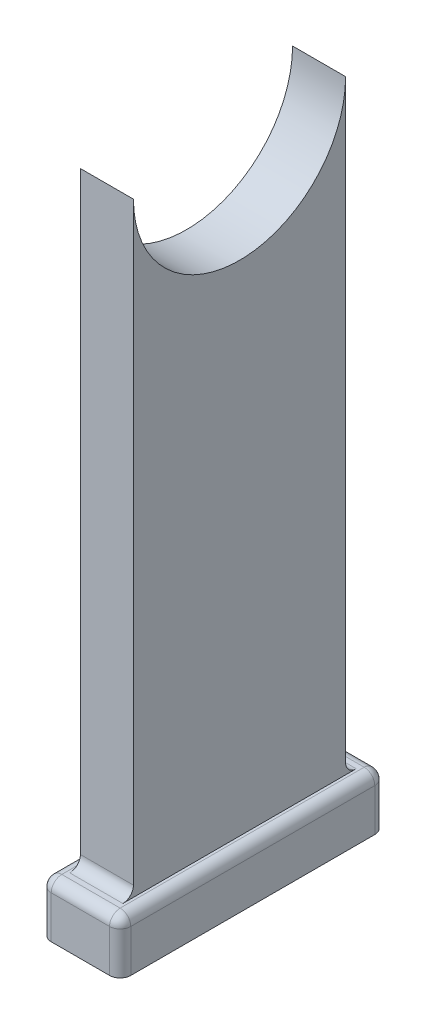
ISO-10303-21;
HEADER;
FILE_DESCRIPTION(('STEP AP214'),'2;1');
FILE_NAME('part.step','',(''),(''),'','','');
FILE_SCHEMA(('AUTOMOTIVE_DESIGN { 1 0 10303 214 1 1 1 1 }'));
ENDSEC;
DATA;
#1=APPLICATION_CONTEXT('core data for automotive mechanical design processes');
#2=APPLICATION_PROTOCOL_DEFINITION('international standard','automotive_design',2000,#1);
#3=PRODUCT_CONTEXT('',#1,'mechanical');
#4=PRODUCT('Part','Part','',(#3));
#5=PRODUCT_RELATED_PRODUCT_CATEGORY('part','',(#4));
#6=PRODUCT_DEFINITION_FORMATION('','',#4);
#7=PRODUCT_DEFINITION_CONTEXT('part definition',#1,'design');
#8=PRODUCT_DEFINITION('design','',#6,#7);
#9=PRODUCT_DEFINITION_SHAPE('','',#8);
#10=(LENGTH_UNIT() NAMED_UNIT(*) SI_UNIT(.MILLI.,.METRE.));
#11=(NAMED_UNIT(*) PLANE_ANGLE_UNIT() SI_UNIT($,.RADIAN.));
#12=(NAMED_UNIT(*) SI_UNIT($,.STERADIAN.) SOLID_ANGLE_UNIT());
#13=UNCERTAINTY_MEASURE_WITH_UNIT(LENGTH_MEASURE(1.E-05),#10,'distance_accuracy_value','');
#14=(GEOMETRIC_REPRESENTATION_CONTEXT(3) GLOBAL_UNCERTAINTY_ASSIGNED_CONTEXT((#13)) GLOBAL_UNIT_ASSIGNED_CONTEXT((#10,
#11,#12)) REPRESENTATION_CONTEXT('',''));
#15=CARTESIAN_POINT('',(0.,0.,0.));
#16=DIRECTION('',(0.,0.,1.));
#17=DIRECTION('',(1.,0.,0.));
#18=AXIS2_PLACEMENT_3D('',#15,#16,#17);
#19=CARTESIAN_POINT('',(-7.5,10.,25.));
#20=DIRECTION('',(1.,0.,0.));
#21=DIRECTION('',(0.,0.,-1.));
#22=AXIS2_PLACEMENT_3D('',#19,#20,#21);
#23=PLANE('',#22);
#24=DIRECTION('',(0.,0.,1.));
#25=VECTOR('',#24,1.);
#26=CARTESIAN_POINT('',(-7.5,8.,-25.));
#27=LINE('',#26,#25);
#28=CARTESIAN_POINT('',(-7.5,8.,23.));
#29=VERTEX_POINT('',#28);
#30=CARTESIAN_POINT('',(-7.5,8.,-23.));
#31=VERTEX_POINT('',#30);
#32=EDGE_CURVE('E226',#29,#31,#27,.F.);
#33=ORIENTED_EDGE('',*,*,#32,.T.);
#34=DIRECTION('',(0.,-1.,0.));
#35=VECTOR('',#34,1.);
#36=CARTESIAN_POINT('',(-7.5,10.,-23.));
#37=LINE('',#36,#35);
#38=CARTESIAN_POINT('',(-7.5,0.,-23.));
#39=VERTEX_POINT('',#38);
#40=EDGE_CURVE('E254',#31,#39,#37,.T.);
#41=ORIENTED_EDGE('',*,*,#40,.T.);
#42=DIRECTION('',(0.,0.,1.));
#43=VECTOR('',#42,1.);
#44=CARTESIAN_POINT('',(-7.5,0.,25.));
#45=LINE('',#44,#43);
#46=CARTESIAN_POINT('',(-7.5,0.,23.));
#47=VERTEX_POINT('',#46);
#48=EDGE_CURVE('E195',#39,#47,#45,.T.);
#49=ORIENTED_EDGE('',*,*,#48,.T.);
#50=DIRECTION('',(0.,-1.,0.));
#51=VECTOR('',#50,1.);
#52=CARTESIAN_POINT('',(-7.5,10.,23.));
#53=LINE('',#52,#51);
#54=EDGE_CURVE('E252',#47,#29,#53,.F.);
#55=ORIENTED_EDGE('',*,*,#54,.T.);
#56=EDGE_LOOP('',(#33,#41,#49,#55));
#57=FACE_BOUND('',#56,.T.);
#58=ADVANCED_FACE('F45',(#57),#23,.F.);
#59=CARTESIAN_POINT('',(7.5,10.,25.));
#60=DIRECTION('',(0.,0.,-1.));
#61=DIRECTION('',(-1.,0.,0.));
#62=AXIS2_PLACEMENT_3D('',#59,#60,#61);
#63=PLANE('',#62);
#64=DIRECTION('',(1.,0.,0.));
#65=VECTOR('',#64,1.);
#66=CARTESIAN_POINT('',(7.5,0.,25.));
#67=LINE('',#66,#65);
#68=CARTESIAN_POINT('',(-5.5,0.,25.));
#69=VERTEX_POINT('',#68);
#70=CARTESIAN_POINT('',(5.5,0.,25.));
#71=VERTEX_POINT('',#70);
#72=EDGE_CURVE('E198',#69,#71,#67,.T.);
#73=ORIENTED_EDGE('',*,*,#72,.T.);
#74=DIRECTION('',(0.,-1.,0.));
#75=VECTOR('',#74,1.);
#76=CARTESIAN_POINT('',(5.5,10.,25.));
#77=LINE('',#76,#75);
#78=CARTESIAN_POINT('',(5.5,8.,25.));
#79=VERTEX_POINT('',#78);
#80=EDGE_CURVE('E274',#71,#79,#77,.F.);
#81=ORIENTED_EDGE('',*,*,#80,.T.);
#82=DIRECTION('',(1.,0.,0.));
#83=VECTOR('',#82,1.);
#84=CARTESIAN_POINT('',(-7.5,8.,25.));
#85=LINE('',#84,#83);
#86=CARTESIAN_POINT('',(-5.5,8.,25.));
#87=VERTEX_POINT('',#86);
#88=EDGE_CURVE('E223',#79,#87,#85,.F.);
#89=ORIENTED_EDGE('',*,*,#88,.T.);
#90=DIRECTION('',(0.,-1.,0.));
#91=VECTOR('',#90,1.);
#92=CARTESIAN_POINT('',(-5.5,10.,25.));
#93=LINE('',#92,#91);
#94=EDGE_CURVE('E272',#87,#69,#93,.T.);
#95=ORIENTED_EDGE('',*,*,#94,.T.);
#96=EDGE_LOOP('',(#73,#81,#89,#95));
#97=FACE_BOUND('',#96,.T.);
#98=ADVANCED_FACE('F319',(#97),#63,.F.);
#99=CARTESIAN_POINT('',(7.5,10.,25.));
#100=DIRECTION('',(-1.,0.,0.));
#101=DIRECTION('',(0.,0.,1.));
#102=AXIS2_PLACEMENT_3D('',#99,#100,#101);
#103=PLANE('',#102);
#104=DIRECTION('',(0.,0.,-1.));
#105=VECTOR('',#104,1.);
#106=CARTESIAN_POINT('',(7.5,0.,25.));
#107=LINE('',#106,#105);
#108=CARTESIAN_POINT('',(7.5,0.,23.));
#109=VERTEX_POINT('',#108);
#110=CARTESIAN_POINT('',(7.5,0.,-23.));
#111=VERTEX_POINT('',#110);
#112=EDGE_CURVE('E202',#109,#111,#107,.T.);
#113=ORIENTED_EDGE('',*,*,#112,.T.);
#114=DIRECTION('',(0.,-1.,0.));
#115=VECTOR('',#114,1.);
#116=CARTESIAN_POINT('',(7.5,10.,-23.));
#117=LINE('',#116,#115);
#118=CARTESIAN_POINT('',(7.5,8.,-23.));
#119=VERTEX_POINT('',#118);
#120=EDGE_CURVE('E270',#111,#119,#117,.F.);
#121=ORIENTED_EDGE('',*,*,#120,.T.);
#122=DIRECTION('',(0.,0.,-1.));
#123=VECTOR('',#122,1.);
#124=CARTESIAN_POINT('',(7.5,8.,25.));
#125=LINE('',#124,#123);
#126=CARTESIAN_POINT('',(7.5,8.,23.));
#127=VERTEX_POINT('',#126);
#128=EDGE_CURVE('E220',#119,#127,#125,.F.);
#129=ORIENTED_EDGE('',*,*,#128,.T.);
#130=DIRECTION('',(0.,-1.,0.));
#131=VECTOR('',#130,1.);
#132=CARTESIAN_POINT('',(7.5,10.,23.));
#133=LINE('',#132,#131);
#134=EDGE_CURVE('E268',#127,#109,#133,.T.);
#135=ORIENTED_EDGE('',*,*,#134,.T.);
#136=EDGE_LOOP('',(#113,#121,#129,#135));
#137=FACE_BOUND('',#136,.T.);
#138=ADVANCED_FACE('F325',(#137),#103,.F.);
#139=CARTESIAN_POINT('',(7.5,10.,-25.));
#140=DIRECTION('',(0.,0.,1.));
#141=DIRECTION('',(1.,0.,0.));
#142=AXIS2_PLACEMENT_3D('',#139,#140,#141);
#143=PLANE('',#142);
#144=DIRECTION('',(-1.,0.,0.));
#145=VECTOR('',#144,1.);
#146=CARTESIAN_POINT('',(7.5,0.,-25.));
#147=LINE('',#146,#145);
#148=CARTESIAN_POINT('',(5.5,0.,-25.));
#149=VERTEX_POINT('',#148);
#150=CARTESIAN_POINT('',(-5.5,0.,-25.));
#151=VERTEX_POINT('',#150);
#152=EDGE_CURVE('E205',#149,#151,#147,.T.);
#153=ORIENTED_EDGE('',*,*,#152,.T.);
#154=DIRECTION('',(0.,-1.,0.));
#155=VECTOR('',#154,1.);
#156=CARTESIAN_POINT('',(-5.5,10.,-25.));
#157=LINE('',#156,#155);
#158=CARTESIAN_POINT('',(-5.5,8.,-25.));
#159=VERTEX_POINT('',#158);
#160=EDGE_CURVE('E266',#151,#159,#157,.F.);
#161=ORIENTED_EDGE('',*,*,#160,.T.);
#162=DIRECTION('',(-1.,0.,0.));
#163=VECTOR('',#162,1.);
#164=CARTESIAN_POINT('',(7.5,8.,-25.));
#165=LINE('',#164,#163);
#166=CARTESIAN_POINT('',(5.5,8.,-25.));
#167=VERTEX_POINT('',#166);
#168=EDGE_CURVE('E229',#159,#167,#165,.F.);
#169=ORIENTED_EDGE('',*,*,#168,.T.);
#170=DIRECTION('',(0.,-1.,0.));
#171=VECTOR('',#170,1.);
#172=CARTESIAN_POINT('',(5.5,10.,-25.));
#173=LINE('',#172,#171);
#174=EDGE_CURVE('E264',#167,#149,#173,.T.);
#175=ORIENTED_EDGE('',*,*,#174,.T.);
#176=EDGE_LOOP('',(#153,#161,#169,#175));
#177=FACE_BOUND('',#176,.T.);
#178=ADVANCED_FACE('F421',(#177),#143,.F.);
#179=CARTESIAN_POINT('',(0.,10.,0.));
#180=DIRECTION('',(0.,1.,0.));
#181=DIRECTION('',(0.,0.,1.));
#182=AXIS2_PLACEMENT_3D('',#179,#180,#181);
#183=PLANE('',#182);
#184=DIRECTION('',(1.,0.,0.));
#185=VECTOR('',#184,1.);
#186=CARTESIAN_POINT('',(0.,10.,-21.9999999999999));
#187=LINE('',#186,#185);
#188=CARTESIAN_POINT('',(-5.,10.,-21.9999999999999));
#189=VERTEX_POINT('',#188);
#190=CARTESIAN_POINT('',(5.,10.,-21.9999999999999));
#191=VERTEX_POINT('',#190);
#192=EDGE_CURVE('E287',#189,#191,#187,.T.);
#193=ORIENTED_EDGE('',*,*,#192,.T.);
#194=DIRECTION('',(0.,0.,-1.));
#195=VECTOR('',#194,1.);
#196=CARTESIAN_POINT('',(5.,10.,0.));
#197=LINE('',#196,#195);
#198=CARTESIAN_POINT('',(5.,10.,22.));
#199=VERTEX_POINT('',#198);
#200=EDGE_CURVE('E192',#199,#191,#197,.T.);
#201=ORIENTED_EDGE('',*,*,#200,.F.);
#202=DIRECTION('',(-1.,0.,0.));
#203=VECTOR('',#202,1.);
#204=CARTESIAN_POINT('',(0.,10.,22.));
#205=LINE('',#204,#203);
#206=CARTESIAN_POINT('',(-5.,10.,22.));
#207=VERTEX_POINT('',#206);
#208=EDGE_CURVE('E276',#199,#207,#205,.T.);
#209=ORIENTED_EDGE('',*,*,#208,.T.);
#210=DIRECTION('',(0.,0.,-1.));
#211=VECTOR('',#210,1.);
#212=CARTESIAN_POINT('',(-5.,10.,0.));
#213=LINE('',#212,#211);
#214=EDGE_CURVE('E177',#207,#189,#213,.T.);
#215=ORIENTED_EDGE('',*,*,#214,.T.);
#216=EDGE_LOOP('',(#193,#201,#209,#215));
#217=FACE_BOUND('',#216,.T.);
#218=DIRECTION('',(1.,0.,0.));
#219=VECTOR('',#218,1.);
#220=CARTESIAN_POINT('',(7.5,10.,23.));
#221=LINE('',#220,#219);
#222=CARTESIAN_POINT('',(-5.5,10.,23.));
#223=VERTEX_POINT('',#222);
#224=CARTESIAN_POINT('',(5.5,10.,23.));
#225=VERTEX_POINT('',#224);
#226=EDGE_CURVE('E214',#223,#225,#221,.T.);
#227=ORIENTED_EDGE('',*,*,#226,.T.);
#228=DIRECTION('',(0.,0.,-1.));
#229=VECTOR('',#228,1.);
#230=CARTESIAN_POINT('',(5.5,10.,-25.));
#231=LINE('',#230,#229);
#232=CARTESIAN_POINT('',(5.5,10.,-23.));
#233=VERTEX_POINT('',#232);
#234=EDGE_CURVE('E217',#225,#233,#231,.T.);
#235=ORIENTED_EDGE('',*,*,#234,.T.);
#236=DIRECTION('',(-1.,0.,0.));
#237=VECTOR('',#236,1.);
#238=CARTESIAN_POINT('',(-7.5,10.,-23.));
#239=LINE('',#238,#237);
#240=CARTESIAN_POINT('',(-5.5,10.,-23.));
#241=VERTEX_POINT('',#240);
#242=EDGE_CURVE('E208',#233,#241,#239,.T.);
#243=ORIENTED_EDGE('',*,*,#242,.T.);
#244=DIRECTION('',(0.,0.,1.));
#245=VECTOR('',#244,1.);
#246=CARTESIAN_POINT('',(-5.5,10.,25.));
#247=LINE('',#246,#245);
#248=EDGE_CURVE('E211',#241,#223,#247,.T.);
#249=ORIENTED_EDGE('',*,*,#248,.T.);
#250=EDGE_LOOP('',(#227,#235,#243,#249));
#251=FACE_BOUND('',#250,.T.);
#252=ADVANCED_FACE('F302',(#217,#251),#183,.T.);
#253=CARTESIAN_POINT('',(0.,0.,0.));
#254=DIRECTION('',(0.,1.,0.));
#255=DIRECTION('',(0.,0.,1.));
#256=AXIS2_PLACEMENT_3D('',#253,#254,#255);
#257=PLANE('',#256);
#258=ORIENTED_EDGE('',*,*,#48,.F.);
#259=CARTESIAN_POINT('',(-5.5,0.,-23.));
#260=DIRECTION('',(0.,1.,0.));
#261=DIRECTION('',(0.,0.,1.));
#262=AXIS2_PLACEMENT_3D('',#259,#260,#261);
#263=CIRCLE('',#262,2.);
#264=EDGE_CURVE('E262',#39,#151,#263,.F.);
#265=ORIENTED_EDGE('',*,*,#264,.T.);
#266=ORIENTED_EDGE('',*,*,#152,.F.);
#267=CARTESIAN_POINT('',(5.5,0.,-23.));
#268=DIRECTION('',(0.,1.,0.));
#269=DIRECTION('',(0.,0.,1.));
#270=AXIS2_PLACEMENT_3D('',#267,#268,#269);
#271=CIRCLE('',#270,2.);
#272=EDGE_CURVE('E260',#149,#111,#271,.F.);
#273=ORIENTED_EDGE('',*,*,#272,.T.);
#274=ORIENTED_EDGE('',*,*,#112,.F.);
#275=CARTESIAN_POINT('',(5.5,0.,23.));
#276=DIRECTION('',(0.,1.,0.));
#277=DIRECTION('',(0.,0.,1.));
#278=AXIS2_PLACEMENT_3D('',#275,#276,#277);
#279=CIRCLE('',#278,2.);
#280=EDGE_CURVE('E258',#109,#71,#279,.F.);
#281=ORIENTED_EDGE('',*,*,#280,.T.);
#282=ORIENTED_EDGE('',*,*,#72,.F.);
#283=CARTESIAN_POINT('',(-5.5,0.,23.));
#284=DIRECTION('',(0.,1.,0.));
#285=DIRECTION('',(0.,0.,1.));
#286=AXIS2_PLACEMENT_3D('',#283,#284,#285);
#287=CIRCLE('',#286,2.);
#288=EDGE_CURVE('E256',#69,#47,#287,.F.);
#289=ORIENTED_EDGE('',*,*,#288,.T.);
#290=EDGE_LOOP('',(#258,#265,#266,#273,#274,#281,#282,#289));
#291=FACE_BOUND('',#290,.T.);
#292=ADVANCED_FACE('F346',(#291),#257,.F.);
#293=CARTESIAN_POINT('',(-5.5,8.,0.));
#294=DIRECTION('',(0.,0.,-1.));
#295=DIRECTION('',(-1.,0.,0.));
#296=AXIS2_PLACEMENT_3D('',#293,#294,#295);
#297=CYLINDRICAL_SURFACE('',#296,2.);
#298=ORIENTED_EDGE('',*,*,#248,.F.);
#299=CARTESIAN_POINT('',(-5.5,8.,-23.));
#300=DIRECTION('',(0.,0.,-1.));
#301=DIRECTION('',(-1.,0.,0.));
#302=AXIS2_PLACEMENT_3D('',#299,#300,#301);
#303=CIRCLE('',#302,2.);
#304=EDGE_CURVE('E239',#241,#31,#303,.F.);
#305=ORIENTED_EDGE('',*,*,#304,.T.);
#306=ORIENTED_EDGE('',*,*,#32,.F.);
#307=CARTESIAN_POINT('',(-5.5,8.,23.));
#308=DIRECTION('',(0.,0.,-1.));
#309=DIRECTION('',(-1.,0.,0.));
#310=AXIS2_PLACEMENT_3D('',#307,#308,#309);
#311=CIRCLE('',#310,2.);
#312=EDGE_CURVE('E237',#29,#223,#311,.T.);
#313=ORIENTED_EDGE('',*,*,#312,.T.);
#314=EDGE_LOOP('',(#298,#305,#306,#313));
#315=FACE_BOUND('',#314,.T.);
#316=ADVANCED_FACE('F342',(#315),#297,.T.);
#317=CARTESIAN_POINT('',(0.,8.,23.));
#318=DIRECTION('',(-1.,0.,0.));
#319=DIRECTION('',(0.,0.,1.));
#320=AXIS2_PLACEMENT_3D('',#317,#318,#319);
#321=CYLINDRICAL_SURFACE('',#320,2.);
#322=ORIENTED_EDGE('',*,*,#88,.F.);
#323=CARTESIAN_POINT('',(5.5,8.,23.));
#324=DIRECTION('',(-1.,0.,0.));
#325=DIRECTION('',(0.,0.,1.));
#326=AXIS2_PLACEMENT_3D('',#323,#324,#325);
#327=CIRCLE('',#326,2.);
#328=EDGE_CURVE('E250',#79,#225,#327,.T.);
#329=ORIENTED_EDGE('',*,*,#328,.T.);
#330=ORIENTED_EDGE('',*,*,#226,.F.);
#331=CARTESIAN_POINT('',(-5.5,8.,23.));
#332=DIRECTION('',(-1.,0.,0.));
#333=DIRECTION('',(0.,0.,1.));
#334=AXIS2_PLACEMENT_3D('',#331,#332,#333);
#335=CIRCLE('',#334,2.);
#336=EDGE_CURVE('E247',#223,#87,#335,.F.);
#337=ORIENTED_EDGE('',*,*,#336,.T.);
#338=EDGE_LOOP('',(#322,#329,#330,#337));
#339=FACE_BOUND('',#338,.T.);
#340=ADVANCED_FACE('F338',(#339),#321,.T.);
#341=CARTESIAN_POINT('',(0.,8.,-23.));
#342=DIRECTION('',(1.,0.,0.));
#343=DIRECTION('',(0.,0.,-1.));
#344=AXIS2_PLACEMENT_3D('',#341,#342,#343);
#345=CYLINDRICAL_SURFACE('',#344,2.);
#346=ORIENTED_EDGE('',*,*,#168,.F.);
#347=CARTESIAN_POINT('',(-5.5,8.,-23.));
#348=DIRECTION('',(1.,0.,0.));
#349=DIRECTION('',(0.,0.,-1.));
#350=AXIS2_PLACEMENT_3D('',#347,#348,#349);
#351=CIRCLE('',#350,2.);
#352=EDGE_CURVE('E234',#159,#241,#351,.T.);
#353=ORIENTED_EDGE('',*,*,#352,.T.);
#354=ORIENTED_EDGE('',*,*,#242,.F.);
#355=CARTESIAN_POINT('',(5.5,8.,-23.));
#356=DIRECTION('',(1.,0.,0.));
#357=DIRECTION('',(0.,0.,-1.));
#358=AXIS2_PLACEMENT_3D('',#355,#356,#357);
#359=CIRCLE('',#358,2.);
#360=EDGE_CURVE('E232',#233,#167,#359,.F.);
#361=ORIENTED_EDGE('',*,*,#360,.T.);
#362=EDGE_LOOP('',(#346,#353,#354,#361));
#363=FACE_BOUND('',#362,.T.);
#364=ADVANCED_FACE('F334',(#363),#345,.T.);
#365=CARTESIAN_POINT('',(5.5,8.,0.));
#366=DIRECTION('',(0.,0.,1.));
#367=DIRECTION('',(1.,0.,0.));
#368=AXIS2_PLACEMENT_3D('',#365,#366,#367);
#369=CYLINDRICAL_SURFACE('',#368,2.);
#370=ORIENTED_EDGE('',*,*,#128,.F.);
#371=CARTESIAN_POINT('',(5.5,8.,-23.));
#372=DIRECTION('',(0.,0.,1.));
#373=DIRECTION('',(1.,0.,0.));
#374=AXIS2_PLACEMENT_3D('',#371,#372,#373);
#375=CIRCLE('',#374,2.);
#376=EDGE_CURVE('E244',#119,#233,#375,.T.);
#377=ORIENTED_EDGE('',*,*,#376,.T.);
#378=ORIENTED_EDGE('',*,*,#234,.F.);
#379=CARTESIAN_POINT('',(5.5,8.,23.));
#380=DIRECTION('',(0.,0.,1.));
#381=DIRECTION('',(1.,0.,0.));
#382=AXIS2_PLACEMENT_3D('',#379,#380,#381);
#383=CIRCLE('',#382,2.);
#384=EDGE_CURVE('E241',#225,#127,#383,.F.);
#385=ORIENTED_EDGE('',*,*,#384,.T.);
#386=EDGE_LOOP('',(#370,#377,#378,#385));
#387=FACE_BOUND('',#386,.T.);
#388=ADVANCED_FACE('F330',(#387),#369,.T.);
#389=CARTESIAN_POINT('',(-5.5,10.,-23.));
#390=DIRECTION('',(0.,-1.,0.));
#391=DIRECTION('',(0.,0.,-1.));
#392=AXIS2_PLACEMENT_3D('',#389,#390,#391);
#393=CYLINDRICAL_SURFACE('',#392,2.);
#394=ORIENTED_EDGE('',*,*,#264,.F.);
#395=ORIENTED_EDGE('',*,*,#40,.F.);
#396=CARTESIAN_POINT('',(-5.5,8.,-23.));
#397=DIRECTION('',(0.,1.,0.));
#398=DIRECTION('',(0.,0.,1.));
#399=AXIS2_PLACEMENT_3D('',#396,#397,#398);
#400=CIRCLE('',#399,2.);
#401=EDGE_CURVE('E199',#159,#31,#400,.T.);
#402=ORIENTED_EDGE('',*,*,#401,.F.);
#403=ORIENTED_EDGE('',*,*,#160,.F.);
#404=EDGE_LOOP('',(#394,#395,#402,#403));
#405=FACE_BOUND('',#404,.T.);
#406=ADVANCED_FACE('F333',(#405),#393,.T.);
#407=CARTESIAN_POINT('',(-5.5,8.,-23.));
#408=DIRECTION('',(0.,0.,1.));
#409=DIRECTION('',(1.,0.,0.));
#410=AXIS2_PLACEMENT_3D('',#407,#408,#409);
#411=SPHERICAL_SURFACE('',#410,2.);
#412=ORIENTED_EDGE('',*,*,#401,.T.);
#413=ORIENTED_EDGE('',*,*,#304,.F.);
#414=ORIENTED_EDGE('',*,*,#352,.F.);
#415=EDGE_LOOP('',(#412,#413,#414));
#416=FACE_BOUND('',#415,.T.);
#417=ADVANCED_FACE('F348',(#416),#411,.T.);
#418=CARTESIAN_POINT('',(5.5,10.,-23.));
#419=DIRECTION('',(0.,-1.,0.));
#420=DIRECTION('',(0.,0.,-1.));
#421=AXIS2_PLACEMENT_3D('',#418,#419,#420);
#422=CYLINDRICAL_SURFACE('',#421,2.);
#423=ORIENTED_EDGE('',*,*,#272,.F.);
#424=ORIENTED_EDGE('',*,*,#174,.F.);
#425=CARTESIAN_POINT('',(5.5,8.,-23.));
#426=DIRECTION('',(0.,1.,0.));
#427=DIRECTION('',(0.,0.,1.));
#428=AXIS2_PLACEMENT_3D('',#425,#426,#427);
#429=CIRCLE('',#428,2.);
#430=EDGE_CURVE('E279',#119,#167,#429,.T.);
#431=ORIENTED_EDGE('',*,*,#430,.F.);
#432=ORIENTED_EDGE('',*,*,#120,.F.);
#433=EDGE_LOOP('',(#423,#424,#431,#432));
#434=FACE_BOUND('',#433,.T.);
#435=ADVANCED_FACE('F351',(#434),#422,.T.);
#436=CARTESIAN_POINT('',(5.5,8.,-23.));
#437=DIRECTION('',(0.,0.,1.));
#438=DIRECTION('',(1.,0.,0.));
#439=AXIS2_PLACEMENT_3D('',#436,#437,#438);
#440=SPHERICAL_SURFACE('',#439,2.);
#441=ORIENTED_EDGE('',*,*,#430,.T.);
#442=ORIENTED_EDGE('',*,*,#360,.F.);
#443=ORIENTED_EDGE('',*,*,#376,.F.);
#444=EDGE_LOOP('',(#441,#442,#443));
#445=FACE_BOUND('',#444,.T.);
#446=ADVANCED_FACE('F356',(#445),#440,.T.);
#447=CARTESIAN_POINT('',(5.5,10.,23.));
#448=DIRECTION('',(0.,-1.,0.));
#449=DIRECTION('',(0.,0.,-1.));
#450=AXIS2_PLACEMENT_3D('',#447,#448,#449);
#451=CYLINDRICAL_SURFACE('',#450,2.);
#452=ORIENTED_EDGE('',*,*,#280,.F.);
#453=ORIENTED_EDGE('',*,*,#134,.F.);
#454=CARTESIAN_POINT('',(5.5,8.,23.));
#455=DIRECTION('',(0.,1.,0.));
#456=DIRECTION('',(0.,0.,1.));
#457=AXIS2_PLACEMENT_3D('',#454,#455,#456);
#458=CIRCLE('',#457,2.);
#459=EDGE_CURVE('E282',#79,#127,#458,.T.);
#460=ORIENTED_EDGE('',*,*,#459,.F.);
#461=ORIENTED_EDGE('',*,*,#80,.F.);
#462=EDGE_LOOP('',(#452,#453,#460,#461));
#463=FACE_BOUND('',#462,.T.);
#464=ADVANCED_FACE('F359',(#463),#451,.T.);
#465=CARTESIAN_POINT('',(5.5,8.,23.));
#466=DIRECTION('',(0.,0.,1.));
#467=DIRECTION('',(1.,0.,0.));
#468=AXIS2_PLACEMENT_3D('',#465,#466,#467);
#469=SPHERICAL_SURFACE('',#468,2.);
#470=ORIENTED_EDGE('',*,*,#384,.F.);
#471=ORIENTED_EDGE('',*,*,#328,.F.);
#472=ORIENTED_EDGE('',*,*,#459,.T.);
#473=EDGE_LOOP('',(#470,#471,#472));
#474=FACE_BOUND('',#473,.T.);
#475=ADVANCED_FACE('F364',(#474),#469,.T.);
#476=CARTESIAN_POINT('',(-5.5,10.,23.));
#477=DIRECTION('',(0.,-1.,0.));
#478=DIRECTION('',(0.,0.,-1.));
#479=AXIS2_PLACEMENT_3D('',#476,#477,#478);
#480=CYLINDRICAL_SURFACE('',#479,2.);
#481=ORIENTED_EDGE('',*,*,#288,.F.);
#482=ORIENTED_EDGE('',*,*,#94,.F.);
#483=CARTESIAN_POINT('',(-5.5,8.,23.));
#484=DIRECTION('',(0.,1.,0.));
#485=DIRECTION('',(0.,0.,1.));
#486=AXIS2_PLACEMENT_3D('',#483,#484,#485);
#487=CIRCLE('',#486,2.);
#488=EDGE_CURVE('E194',#29,#87,#487,.T.);
#489=ORIENTED_EDGE('',*,*,#488,.F.);
#490=ORIENTED_EDGE('',*,*,#54,.F.);
#491=EDGE_LOOP('',(#481,#482,#489,#490));
#492=FACE_BOUND('',#491,.T.);
#493=ADVANCED_FACE('F367',(#492),#480,.T.);
#494=CARTESIAN_POINT('',(-5.5,8.,23.));
#495=DIRECTION('',(0.,0.,1.));
#496=DIRECTION('',(1.,0.,0.));
#497=AXIS2_PLACEMENT_3D('',#494,#495,#496);
#498=SPHERICAL_SURFACE('',#497,2.);
#499=ORIENTED_EDGE('',*,*,#336,.F.);
#500=ORIENTED_EDGE('',*,*,#312,.F.);
#501=ORIENTED_EDGE('',*,*,#488,.T.);
#502=EDGE_LOOP('',(#499,#500,#501));
#503=FACE_BOUND('',#502,.T.);
#504=ADVANCED_FACE('F372',(#503),#498,.T.);
#505=CARTESIAN_POINT('',(5.,124.,-20.));
#506=DIRECTION('',(0.,0.,1.));
#507=DIRECTION('',(0.,-1.,0.));
#508=AXIS2_PLACEMENT_3D('',#505,#506,#507);
#509=PLANE('',#508);
#510=DIRECTION('',(0.,1.,0.));
#511=VECTOR('',#510,1.);
#512=CARTESIAN_POINT('',(5.,0.,-20.));
#513=LINE('',#512,#511);
#514=CARTESIAN_POINT('',(5.,12.,-20.));
#515=VERTEX_POINT('',#514);
#516=CARTESIAN_POINT('',(5.,124.,-20.));
#517=VERTEX_POINT('',#516);
#518=EDGE_CURVE('E157',#515,#517,#513,.T.);
#519=ORIENTED_EDGE('',*,*,#518,.F.);
#520=DIRECTION('',(1.,0.,0.));
#521=VECTOR('',#520,1.);
#522=CARTESIAN_POINT('',(5.,12.,-19.9999999999999));
#523=LINE('',#522,#521);
#524=CARTESIAN_POINT('',(-5.,12.,-19.9999999999999));
#525=VERTEX_POINT('',#524);
#526=EDGE_CURVE('E290',#515,#525,#523,.F.);
#527=ORIENTED_EDGE('',*,*,#526,.T.);
#528=DIRECTION('',(0.,1.,0.));
#529=VECTOR('',#528,1.);
#530=CARTESIAN_POINT('',(-5.,124.,-20.));
#531=LINE('',#530,#529);
#532=CARTESIAN_POINT('',(-5.,124.,-20.));
#533=VERTEX_POINT('',#532);
#534=EDGE_CURVE('E173',#525,#533,#531,.T.);
#535=ORIENTED_EDGE('',*,*,#534,.T.);
#536=DIRECTION('',(-1.,0.,0.));
#537=VECTOR('',#536,1.);
#538=CARTESIAN_POINT('',(5.,124.,-20.));
#539=LINE('',#538,#537);
#540=EDGE_CURVE('E170',#517,#533,#539,.T.);
#541=ORIENTED_EDGE('',*,*,#540,.F.);
#542=EDGE_LOOP('',(#519,#527,#535,#541));
#543=FACE_BOUND('',#542,.T.);
#544=ADVANCED_FACE('F171',(#543),#509,.F.);
#545=CARTESIAN_POINT('',(5.,124.,0.));
#546=DIRECTION('',(-1.,0.,0.));
#547=DIRECTION('',(0.,0.,1.));
#548=AXIS2_PLACEMENT_3D('',#545,#546,#547);
#549=CYLINDRICAL_SURFACE('',#548,20.);
#550=CARTESIAN_POINT('',(-5.,124.,0.));
#551=DIRECTION('',(-1.,0.,0.));
#552=DIRECTION('',(0.,0.,-1.));
#553=AXIS2_PLACEMENT_3D('',#550,#551,#552);
#554=CIRCLE('',#553,20.);
#555=CARTESIAN_POINT('',(-5.,124.,20.));
#556=VERTEX_POINT('',#555);
#557=EDGE_CURVE('E187',#533,#556,#554,.T.);
#558=ORIENTED_EDGE('',*,*,#557,.T.);
#559=DIRECTION('',(-1.,0.,0.));
#560=VECTOR('',#559,1.);
#561=CARTESIAN_POINT('',(5.,124.,20.));
#562=LINE('',#561,#560);
#563=CARTESIAN_POINT('',(5.,124.,20.));
#564=VERTEX_POINT('',#563);
#565=EDGE_CURVE('E178',#564,#556,#562,.T.);
#566=ORIENTED_EDGE('',*,*,#565,.F.);
#567=CARTESIAN_POINT('',(5.,124.,0.));
#568=DIRECTION('',(-1.,0.,0.));
#569=DIRECTION('',(0.,0.,-1.));
#570=AXIS2_PLACEMENT_3D('',#567,#568,#569);
#571=CIRCLE('',#570,20.);
#572=EDGE_CURVE('E161',#517,#564,#571,.T.);
#573=ORIENTED_EDGE('',*,*,#572,.F.);
#574=ORIENTED_EDGE('',*,*,#540,.T.);
#575=EDGE_LOOP('',(#558,#566,#573,#574));
#576=FACE_BOUND('',#575,.T.);
#577=ADVANCED_FACE('F180',(#576),#549,.F.);
#578=CARTESIAN_POINT('',(5.,0.,20.));
#579=DIRECTION('',(0.,0.,-1.));
#580=DIRECTION('',(0.,1.,0.));
#581=AXIS2_PLACEMENT_3D('',#578,#579,#580);
#582=PLANE('',#581);
#583=DIRECTION('',(0.,-1.,0.));
#584=VECTOR('',#583,1.);
#585=CARTESIAN_POINT('',(-5.,0.,20.));
#586=LINE('',#585,#584);
#587=CARTESIAN_POINT('',(-5.,12.,20.));
#588=VERTEX_POINT('',#587);
#589=EDGE_CURVE('E167',#556,#588,#586,.T.);
#590=ORIENTED_EDGE('',*,*,#589,.T.);
#591=DIRECTION('',(-1.,0.,0.));
#592=VECTOR('',#591,1.);
#593=CARTESIAN_POINT('',(5.,12.,20.));
#594=LINE('',#593,#592);
#595=CARTESIAN_POINT('',(5.,12.,20.));
#596=VERTEX_POINT('',#595);
#597=EDGE_CURVE('E66',#588,#596,#594,.F.);
#598=ORIENTED_EDGE('',*,*,#597,.T.);
#599=DIRECTION('',(0.,-1.,0.));
#600=VECTOR('',#599,1.);
#601=CARTESIAN_POINT('',(5.,124.,20.));
#602=LINE('',#601,#600);
#603=EDGE_CURVE('E182',#564,#596,#602,.T.);
#604=ORIENTED_EDGE('',*,*,#603,.F.);
#605=ORIENTED_EDGE('',*,*,#565,.T.);
#606=EDGE_LOOP('',(#590,#598,#604,#605));
#607=FACE_BOUND('',#606,.T.);
#608=ADVANCED_FACE('F307',(#607),#582,.F.);
#609=CARTESIAN_POINT('',(5.,124.,0.));
#610=DIRECTION('',(1.,0.,0.));
#611=DIRECTION('',(0.,0.,-1.));
#612=AXIS2_PLACEMENT_3D('',#609,#610,#611);
#613=PLANE('',#612);
#614=ORIENTED_EDGE('',*,*,#603,.T.);
#615=CARTESIAN_POINT('',(5.,12.,22.));
#616=DIRECTION('',(1.,0.,0.));
#617=DIRECTION('',(0.,0.,-1.));
#618=AXIS2_PLACEMENT_3D('',#615,#616,#617);
#619=CIRCLE('',#618,2.);
#620=EDGE_CURVE('E11',#596,#199,#619,.F.);
#621=ORIENTED_EDGE('',*,*,#620,.T.);
#622=ORIENTED_EDGE('',*,*,#200,.T.);
#623=CARTESIAN_POINT('',(5.,12.,-21.9999999999999));
#624=DIRECTION('',(1.,0.,0.));
#625=DIRECTION('',(0.,0.,-1.));
#626=AXIS2_PLACEMENT_3D('',#623,#624,#625);
#627=CIRCLE('',#626,2.);
#628=EDGE_CURVE('E164',#191,#515,#627,.F.);
#629=ORIENTED_EDGE('',*,*,#628,.T.);
#630=ORIENTED_EDGE('',*,*,#518,.T.);
#631=ORIENTED_EDGE('',*,*,#572,.T.);
#632=EDGE_LOOP('',(#614,#621,#622,#629,#630,#631));
#633=FACE_BOUND('',#632,.T.);
#634=ADVANCED_FACE('F159',(#633),#613,.T.);
#635=CARTESIAN_POINT('',(-5.,124.,0.));
#636=DIRECTION('',(1.,0.,0.));
#637=DIRECTION('',(0.,0.,-1.));
#638=AXIS2_PLACEMENT_3D('',#635,#636,#637);
#639=PLANE('',#638);
#640=ORIENTED_EDGE('',*,*,#214,.F.);
#641=CARTESIAN_POINT('',(-5.,12.,22.));
#642=DIRECTION('',(1.,0.,0.));
#643=DIRECTION('',(0.,0.,-1.));
#644=AXIS2_PLACEMENT_3D('',#641,#642,#643);
#645=CIRCLE('',#644,2.);
#646=EDGE_CURVE('E53',#207,#588,#645,.T.);
#647=ORIENTED_EDGE('',*,*,#646,.T.);
#648=ORIENTED_EDGE('',*,*,#589,.F.);
#649=ORIENTED_EDGE('',*,*,#557,.F.);
#650=ORIENTED_EDGE('',*,*,#534,.F.);
#651=CARTESIAN_POINT('',(-5.,12.,-21.9999999999999));
#652=DIRECTION('',(1.,0.,0.));
#653=DIRECTION('',(0.,0.,-1.));
#654=AXIS2_PLACEMENT_3D('',#651,#652,#653);
#655=CIRCLE('',#654,2.);
#656=EDGE_CURVE('E294',#525,#189,#655,.T.);
#657=ORIENTED_EDGE('',*,*,#656,.T.);
#658=EDGE_LOOP('',(#640,#647,#648,#649,#650,#657));
#659=FACE_BOUND('',#658,.T.);
#660=ADVANCED_FACE('F298',(#659),#639,.F.);
#661=CARTESIAN_POINT('',(0.,12.,-21.9999999999999));
#662=DIRECTION('',(1.,0.,0.));
#663=DIRECTION('',(0.,0.,-1.));
#664=AXIS2_PLACEMENT_3D('',#661,#662,#663);
#665=CYLINDRICAL_SURFACE('',#664,2.);
#666=ORIENTED_EDGE('',*,*,#656,.F.);
#667=ORIENTED_EDGE('',*,*,#526,.F.);
#668=ORIENTED_EDGE('',*,*,#628,.F.);
#669=ORIENTED_EDGE('',*,*,#192,.F.);
#670=EDGE_LOOP('',(#666,#667,#668,#669));
#671=FACE_BOUND('',#670,.T.);
#672=ADVANCED_FACE('F300',(#671),#665,.F.);
#673=CARTESIAN_POINT('',(0.,12.,22.));
#674=DIRECTION('',(-1.,0.,0.));
#675=DIRECTION('',(0.,0.,1.));
#676=AXIS2_PLACEMENT_3D('',#673,#674,#675);
#677=CYLINDRICAL_SURFACE('',#676,2.);
#678=ORIENTED_EDGE('',*,*,#620,.F.);
#679=ORIENTED_EDGE('',*,*,#597,.F.);
#680=ORIENTED_EDGE('',*,*,#646,.F.);
#681=ORIENTED_EDGE('',*,*,#208,.F.);
#682=EDGE_LOOP('',(#678,#679,#680,#681));
#683=FACE_BOUND('',#682,.T.);
#684=ADVANCED_FACE('F47',(#683),#677,.F.);
#685=CLOSED_SHELL('',(#58,#98,#138,#178,#252,#292,#316,#340,#364,#388,#406,#417,#435,#446,#464,
#475,#493,#504,#544,#577,#608,#634,#660,#672,#684));
#686=MANIFOLD_SOLID_BREP('B2',#685);
#687=ADVANCED_BREP_SHAPE_REPRESENTATION('',(#18,#686),#14);
#688=SHAPE_DEFINITION_REPRESENTATION(#9,#687);
ENDSEC;
END-ISO-10303-21;
